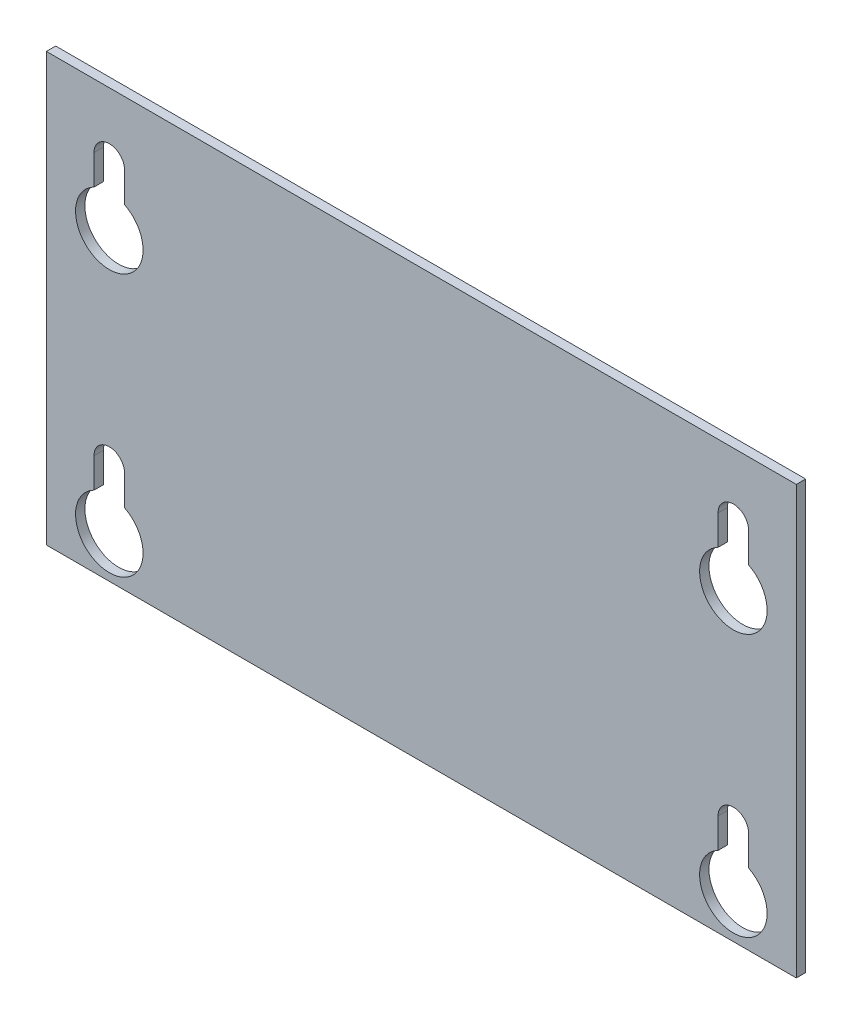
ISO-10303-21;
HEADER;
FILE_DESCRIPTION(('STEP AP214'),'2;1');
FILE_NAME('part.step','',(''),(''),'','','');
FILE_SCHEMA(('AUTOMOTIVE_DESIGN { 1 0 10303 214 1 1 1 1 }'));
ENDSEC;
DATA;
#1=APPLICATION_CONTEXT('core data for automotive mechanical design processes');
#2=APPLICATION_PROTOCOL_DEFINITION('international standard','automotive_design',2000,#1);
#3=PRODUCT_CONTEXT('',#1,'mechanical');
#4=PRODUCT('Part','Part','',(#3));
#5=PRODUCT_RELATED_PRODUCT_CATEGORY('part','',(#4));
#6=PRODUCT_DEFINITION_FORMATION('','',#4);
#7=PRODUCT_DEFINITION_CONTEXT('part definition',#1,'design');
#8=PRODUCT_DEFINITION('design','',#6,#7);
#9=PRODUCT_DEFINITION_SHAPE('','',#8);
#10=(LENGTH_UNIT() NAMED_UNIT(*) SI_UNIT(.MILLI.,.METRE.));
#11=(NAMED_UNIT(*) PLANE_ANGLE_UNIT() SI_UNIT($,.RADIAN.));
#12=(NAMED_UNIT(*) SI_UNIT($,.STERADIAN.) SOLID_ANGLE_UNIT());
#13=UNCERTAINTY_MEASURE_WITH_UNIT(LENGTH_MEASURE(1.E-05),#10,'distance_accuracy_value','');
#14=(GEOMETRIC_REPRESENTATION_CONTEXT(3) GLOBAL_UNCERTAINTY_ASSIGNED_CONTEXT((#13)) GLOBAL_UNIT_ASSIGNED_CONTEXT((#10,
#11,#12)) REPRESENTATION_CONTEXT('',''));
#15=CARTESIAN_POINT('',(0.,0.,0.));
#16=DIRECTION('',(0.,0.,1.));
#17=DIRECTION('',(1.,0.,0.));
#18=AXIS2_PLACEMENT_3D('',#15,#16,#17);
#19=CARTESIAN_POINT('',(50.,31.,-1.245));
#20=DIRECTION('',(1.,0.,0.));
#21=DIRECTION('',(0.,1.,0.));
#22=AXIS2_PLACEMENT_3D('',#19,#20,#21);
#23=PLANE('',#22);
#24=DIRECTION('',(0.,1.,0.));
#25=VECTOR('',#24,1.);
#26=CARTESIAN_POINT('',(50.,31.,0.));
#27=LINE('',#26,#25);
#28=CARTESIAN_POINT('',(50.,-31.,0.));
#29=VERTEX_POINT('',#28);
#30=CARTESIAN_POINT('',(50.,26.,0.));
#31=VERTEX_POINT('',#30);
#32=EDGE_CURVE('E218',#29,#31,#27,.T.);
#33=ORIENTED_EDGE('',*,*,#32,.F.);
#34=DIRECTION('',(0.,0.,1.));
#35=VECTOR('',#34,1.);
#36=CARTESIAN_POINT('',(50.,-31.,-1.245));
#37=LINE('',#36,#35);
#38=CARTESIAN_POINT('',(50.,-31.,-1.245));
#39=VERTEX_POINT('',#38);
#40=EDGE_CURVE('E12',#39,#29,#37,.T.);
#41=ORIENTED_EDGE('',*,*,#40,.F.);
#42=DIRECTION('',(0.,1.,0.));
#43=VECTOR('',#42,1.);
#44=CARTESIAN_POINT('',(50.,31.,-1.245));
#45=LINE('',#44,#43);
#46=CARTESIAN_POINT('',(50.,26.,-1.245));
#47=VERTEX_POINT('',#46);
#48=EDGE_CURVE('E219',#39,#47,#45,.T.);
#49=ORIENTED_EDGE('',*,*,#48,.T.);
#50=DIRECTION('',(0.,0.,1.));
#51=VECTOR('',#50,1.);
#52=CARTESIAN_POINT('',(50.,26.,-1.245));
#53=LINE('',#52,#51);
#54=EDGE_CURVE('E41',#47,#31,#53,.T.);
#55=ORIENTED_EDGE('',*,*,#54,.T.);
#56=EDGE_LOOP('',(#33,#41,#49,#55));
#57=FACE_BOUND('',#56,.T.);
#58=ADVANCED_FACE('F37',(#57),#23,.T.);
#59=CARTESIAN_POINT('',(-50.,-31.,-1.245));
#60=DIRECTION('',(0.,-1.,0.));
#61=DIRECTION('',(0.,0.,-1.));
#62=AXIS2_PLACEMENT_3D('',#59,#60,#61);
#63=PLANE('',#62);
#64=DIRECTION('',(1.,0.,0.));
#65=VECTOR('',#64,1.);
#66=CARTESIAN_POINT('',(-50.,-31.,0.));
#67=LINE('',#66,#65);
#68=CARTESIAN_POINT('',(-50.,-31.,0.));
#69=VERTEX_POINT('',#68);
#70=EDGE_CURVE('E223',#69,#29,#67,.T.);
#71=ORIENTED_EDGE('',*,*,#70,.F.);
#72=DIRECTION('',(0.,0.,1.));
#73=VECTOR('',#72,1.);
#74=CARTESIAN_POINT('',(-50.,-31.,-1.245));
#75=LINE('',#74,#73);
#76=CARTESIAN_POINT('',(-50.,-31.,-1.245));
#77=VERTEX_POINT('',#76);
#78=EDGE_CURVE('E47',#77,#69,#75,.T.);
#79=ORIENTED_EDGE('',*,*,#78,.F.);
#80=DIRECTION('',(1.,0.,0.));
#81=VECTOR('',#80,1.);
#82=CARTESIAN_POINT('',(-50.,-31.,-1.245));
#83=LINE('',#82,#81);
#84=EDGE_CURVE('E227',#77,#39,#83,.T.);
#85=ORIENTED_EDGE('',*,*,#84,.T.);
#86=ORIENTED_EDGE('',*,*,#40,.T.);
#87=EDGE_LOOP('',(#71,#79,#85,#86));
#88=FACE_BOUND('',#87,.T.);
#89=ADVANCED_FACE('F378',(#88),#63,.T.);
#90=CARTESIAN_POINT('',(-50.,31.,-1.245));
#91=DIRECTION('',(-1.,0.,0.));
#92=DIRECTION('',(0.,-1.,0.));
#93=AXIS2_PLACEMENT_3D('',#90,#91,#92);
#94=PLANE('',#93);
#95=DIRECTION('',(0.,-1.,0.));
#96=VECTOR('',#95,1.);
#97=CARTESIAN_POINT('',(-50.,31.,0.));
#98=LINE('',#97,#96);
#99=CARTESIAN_POINT('',(-50.,26.,0.));
#100=VERTEX_POINT('',#99);
#101=EDGE_CURVE('E232',#100,#69,#98,.T.);
#102=ORIENTED_EDGE('',*,*,#101,.F.);
#103=DIRECTION('',(0.,0.,1.));
#104=VECTOR('',#103,1.);
#105=CARTESIAN_POINT('',(-50.,26.,-1.245));
#106=LINE('',#105,#104);
#107=CARTESIAN_POINT('',(-50.,26.,-1.245));
#108=VERTEX_POINT('',#107);
#109=EDGE_CURVE('E238',#108,#100,#106,.T.);
#110=ORIENTED_EDGE('',*,*,#109,.F.);
#111=DIRECTION('',(0.,-1.,0.));
#112=VECTOR('',#111,1.);
#113=CARTESIAN_POINT('',(-50.,31.,-1.245));
#114=LINE('',#113,#112);
#115=EDGE_CURVE('E224',#108,#77,#114,.T.);
#116=ORIENTED_EDGE('',*,*,#115,.T.);
#117=ORIENTED_EDGE('',*,*,#78,.T.);
#118=EDGE_LOOP('',(#102,#110,#116,#117));
#119=FACE_BOUND('',#118,.T.);
#120=ADVANCED_FACE('F382',(#119),#94,.T.);
#121=CARTESIAN_POINT('',(-50.,26.,-1.245));
#122=DIRECTION('',(0.,1.,0.));
#123=DIRECTION('',(0.,0.,1.));
#124=AXIS2_PLACEMENT_3D('',#121,#122,#123);
#125=PLANE('',#124);
#126=DIRECTION('',(-1.,0.,0.));
#127=VECTOR('',#126,1.);
#128=CARTESIAN_POINT('',(0.,26.,0.));
#129=LINE('',#128,#127);
#130=EDGE_CURVE('E231',#31,#100,#129,.T.);
#131=ORIENTED_EDGE('',*,*,#130,.F.);
#132=ORIENTED_EDGE('',*,*,#54,.F.);
#133=DIRECTION('',(-1.,0.,0.));
#134=VECTOR('',#133,1.);
#135=CARTESIAN_POINT('',(0.,26.,-1.245));
#136=LINE('',#135,#134);
#137=EDGE_CURVE('E222',#47,#108,#136,.T.);
#138=ORIENTED_EDGE('',*,*,#137,.T.);
#139=ORIENTED_EDGE('',*,*,#109,.T.);
#140=EDGE_LOOP('',(#131,#132,#138,#139));
#141=FACE_BOUND('',#140,.T.);
#142=ADVANCED_FACE('F39',(#141),#125,.T.);
#143=CARTESIAN_POINT('',(0.,0.,-1.245));
#144=DIRECTION('',(0.,0.,1.));
#145=DIRECTION('',(1.,0.,0.));
#146=AXIS2_PLACEMENT_3D('',#143,#144,#145);
#147=PLANE('',#146);
#148=DIRECTION('',(0.,1.,0.));
#149=VECTOR('',#148,1.);
#150=CARTESIAN_POINT('',(43.6450000000001,-1.51842900438098E-13,-1.245));
#151=LINE('',#150,#149);
#152=CARTESIAN_POINT('',(43.645,-21.488965220794,-1.245));
#153=VERTEX_POINT('',#152);
#154=CARTESIAN_POINT('',(43.645,-17.5,-1.245));
#155=VERTEX_POINT('',#154);
#156=EDGE_CURVE('E342',#153,#155,#151,.T.);
#157=ORIENTED_EDGE('',*,*,#156,.T.);
#158=CARTESIAN_POINT('',(41.605,-17.5,-1.245));
#159=DIRECTION('',(0.,0.,1.));
#160=DIRECTION('',(1.,0.,0.));
#161=AXIS2_PLACEMENT_3D('',#158,#159,#160);
#162=CIRCLE('',#161,2.04000000000001);
#163=CARTESIAN_POINT('',(39.565,-17.5,-1.245));
#164=VERTEX_POINT('',#163);
#165=EDGE_CURVE('E345',#155,#164,#162,.T.);
#166=ORIENTED_EDGE('',*,*,#165,.T.);
#167=DIRECTION('',(0.,-1.,0.));
#168=VECTOR('',#167,1.);
#169=CARTESIAN_POINT('',(39.5650000000001,-1.37648398575629E-13,-1.245));
#170=LINE('',#169,#168);
#171=CARTESIAN_POINT('',(39.565,-21.488965220794,-1.245));
#172=VERTEX_POINT('',#171);
#173=EDGE_CURVE('E337',#164,#172,#170,.T.);
#174=ORIENTED_EDGE('',*,*,#173,.T.);
#175=CARTESIAN_POINT('',(41.605,-25.5,-1.245));
#176=DIRECTION('',(0.,0.,1.));
#177=DIRECTION('',(1.,0.,0.));
#178=AXIS2_PLACEMENT_3D('',#175,#176,#177);
#179=CIRCLE('',#178,4.5);
#180=EDGE_CURVE('E313',#172,#153,#179,.T.);
#181=ORIENTED_EDGE('',*,*,#180,.T.);
#182=EDGE_LOOP('',(#157,#166,#174,#181));
#183=FACE_BOUND('',#182,.T.);
#184=DIRECTION('',(0.,1.,0.));
#185=VECTOR('',#184,1.);
#186=CARTESIAN_POINT('',(-39.565,0.,-1.245));
#187=LINE('',#186,#185);
#188=CARTESIAN_POINT('',(-39.565,-21.488965220794,-1.245));
#189=VERTEX_POINT('',#188);
#190=CARTESIAN_POINT('',(-39.565,-17.5,-1.245));
#191=VERTEX_POINT('',#190);
#192=EDGE_CURVE('E133',#189,#191,#187,.T.);
#193=ORIENTED_EDGE('',*,*,#192,.T.);
#194=CARTESIAN_POINT('',(-41.605,-17.5,-1.245));
#195=DIRECTION('',(0.,0.,1.));
#196=DIRECTION('',(1.,0.,0.));
#197=AXIS2_PLACEMENT_3D('',#194,#195,#196);
#198=CIRCLE('',#197,2.04);
#199=CARTESIAN_POINT('',(-43.645,-17.5,-1.245));
#200=VERTEX_POINT('',#199);
#201=EDGE_CURVE('E139',#191,#200,#198,.T.);
#202=ORIENTED_EDGE('',*,*,#201,.T.);
#203=DIRECTION('',(0.,-1.,0.));
#204=VECTOR('',#203,1.);
#205=CARTESIAN_POINT('',(-43.6449999999999,1.51842900438098E-13,-1.245));
#206=LINE('',#205,#204);
#207=CARTESIAN_POINT('',(-43.645,-21.488965220794,-1.245));
#208=VERTEX_POINT('',#207);
#209=EDGE_CURVE('E114',#200,#208,#206,.T.);
#210=ORIENTED_EDGE('',*,*,#209,.T.);
#211=CARTESIAN_POINT('',(-41.605,-25.5,-1.245));
#212=DIRECTION('',(0.,0.,1.));
#213=DIRECTION('',(1.,0.,0.));
#214=AXIS2_PLACEMENT_3D('',#211,#212,#213);
#215=CIRCLE('',#214,4.5);
#216=EDGE_CURVE('E127',#208,#189,#215,.T.);
#217=ORIENTED_EDGE('',*,*,#216,.T.);
#218=EDGE_LOOP('',(#193,#202,#210,#217));
#219=FACE_BOUND('',#218,.T.);
#220=DIRECTION('',(0.,1.,0.));
#221=VECTOR('',#220,1.);
#222=CARTESIAN_POINT('',(43.645,0.,-1.245));
#223=LINE('',#222,#221);
#224=CARTESIAN_POINT('',(43.645,13.511034779206,-1.245));
#225=VERTEX_POINT('',#224);
#226=CARTESIAN_POINT('',(43.645,17.5,-1.245));
#227=VERTEX_POINT('',#226);
#228=EDGE_CURVE('E177',#225,#227,#223,.T.);
#229=ORIENTED_EDGE('',*,*,#228,.T.);
#230=CARTESIAN_POINT('',(41.605,17.5,-1.245));
#231=DIRECTION('',(0.,0.,1.));
#232=DIRECTION('',(1.,0.,0.));
#233=AXIS2_PLACEMENT_3D('',#230,#231,#232);
#234=CIRCLE('',#233,2.04000000000001);
#235=CARTESIAN_POINT('',(39.565,17.5,-1.245));
#236=VERTEX_POINT('',#235);
#237=EDGE_CURVE('E180',#227,#236,#234,.T.);
#238=ORIENTED_EDGE('',*,*,#237,.T.);
#239=DIRECTION('',(0.,-1.,0.));
#240=VECTOR('',#239,1.);
#241=CARTESIAN_POINT('',(39.565,0.,-1.245));
#242=LINE('',#241,#240);
#243=CARTESIAN_POINT('',(39.565,13.511034779206,-1.245));
#244=VERTEX_POINT('',#243);
#245=EDGE_CURVE('E163',#236,#244,#242,.T.);
#246=ORIENTED_EDGE('',*,*,#245,.T.);
#247=CARTESIAN_POINT('',(41.605,9.5,-1.245));
#248=DIRECTION('',(0.,0.,1.));
#249=DIRECTION('',(1.,0.,0.));
#250=AXIS2_PLACEMENT_3D('',#247,#248,#249);
#251=CIRCLE('',#250,4.5);
#252=EDGE_CURVE('E174',#244,#225,#251,.T.);
#253=ORIENTED_EDGE('',*,*,#252,.T.);
#254=EDGE_LOOP('',(#229,#238,#246,#253));
#255=FACE_BOUND('',#254,.T.);
#256=DIRECTION('',(0.,1.,0.));
#257=VECTOR('',#256,1.);
#258=CARTESIAN_POINT('',(-39.565,0.,-1.245));
#259=LINE('',#258,#257);
#260=CARTESIAN_POINT('',(-39.565,13.511034779206,-1.245));
#261=VERTEX_POINT('',#260);
#262=CARTESIAN_POINT('',(-39.565,17.5,-1.245));
#263=VERTEX_POINT('',#262);
#264=EDGE_CURVE('E212',#261,#263,#259,.T.);
#265=ORIENTED_EDGE('',*,*,#264,.T.);
#266=CARTESIAN_POINT('',(-41.605,17.5,-1.245));
#267=DIRECTION('',(0.,0.,1.));
#268=DIRECTION('',(1.,0.,0.));
#269=AXIS2_PLACEMENT_3D('',#266,#267,#268);
#270=CIRCLE('',#269,2.04000000000001);
#271=CARTESIAN_POINT('',(-43.645,17.5,-1.245));
#272=VERTEX_POINT('',#271);
#273=EDGE_CURVE('E215',#263,#272,#270,.T.);
#274=ORIENTED_EDGE('',*,*,#273,.T.);
#275=DIRECTION('',(0.,-1.,0.));
#276=VECTOR('',#275,1.);
#277=CARTESIAN_POINT('',(-43.645,0.,-1.245));
#278=LINE('',#277,#276);
#279=CARTESIAN_POINT('',(-43.645,13.511034779206,-1.245));
#280=VERTEX_POINT('',#279);
#281=EDGE_CURVE('E198',#272,#280,#278,.T.);
#282=ORIENTED_EDGE('',*,*,#281,.T.);
#283=CARTESIAN_POINT('',(-41.605,9.5,-1.245));
#284=DIRECTION('',(0.,0.,1.));
#285=DIRECTION('',(1.,0.,0.));
#286=AXIS2_PLACEMENT_3D('',#283,#284,#285);
#287=CIRCLE('',#286,4.5);
#288=EDGE_CURVE('E209',#280,#261,#287,.T.);
#289=ORIENTED_EDGE('',*,*,#288,.T.);
#290=EDGE_LOOP('',(#265,#274,#282,#289));
#291=FACE_BOUND('',#290,.T.);
#292=ORIENTED_EDGE('',*,*,#48,.F.);
#293=ORIENTED_EDGE('',*,*,#84,.F.);
#294=ORIENTED_EDGE('',*,*,#115,.F.);
#295=ORIENTED_EDGE('',*,*,#137,.F.);
#296=EDGE_LOOP('',(#292,#293,#294,#295));
#297=FACE_BOUND('',#296,.T.);
#298=ADVANCED_FACE('F136',(#183,#219,#255,#291,#297),#147,.F.);
#299=CARTESIAN_POINT('',(0.,0.,0.));
#300=DIRECTION('',(0.,0.,1.));
#301=DIRECTION('',(1.,0.,0.));
#302=AXIS2_PLACEMENT_3D('',#299,#300,#301);
#303=PLANE('',#302);
#304=CARTESIAN_POINT('',(41.605,-17.5,0.));
#305=DIRECTION('',(0.,0.,1.));
#306=DIRECTION('',(1.,0.,0.));
#307=AXIS2_PLACEMENT_3D('',#304,#305,#306);
#308=CIRCLE('',#307,2.04000000000001);
#309=CARTESIAN_POINT('',(43.645,-17.5,0.));
#310=VERTEX_POINT('',#309);
#311=CARTESIAN_POINT('',(39.565,-17.5,0.));
#312=VERTEX_POINT('',#311);
#313=EDGE_CURVE('E325',#310,#312,#308,.T.);
#314=ORIENTED_EDGE('',*,*,#313,.F.);
#315=DIRECTION('',(0.,1.,0.));
#316=VECTOR('',#315,1.);
#317=CARTESIAN_POINT('',(43.645,-17.5,0.));
#318=LINE('',#317,#316);
#319=CARTESIAN_POINT('',(43.645,-21.488965220794,0.));
#320=VERTEX_POINT('',#319);
#321=EDGE_CURVE('E330',#320,#310,#318,.T.);
#322=ORIENTED_EDGE('',*,*,#321,.F.);
#323=CARTESIAN_POINT('',(41.605,-25.5,0.));
#324=DIRECTION('',(0.,0.,1.));
#325=DIRECTION('',(1.,0.,0.));
#326=AXIS2_PLACEMENT_3D('',#323,#324,#325);
#327=CIRCLE('',#326,4.5);
#328=CARTESIAN_POINT('',(39.565,-21.488965220794,0.));
#329=VERTEX_POINT('',#328);
#330=EDGE_CURVE('E310',#329,#320,#327,.T.);
#331=ORIENTED_EDGE('',*,*,#330,.F.);
#332=DIRECTION('',(0.,-1.,0.));
#333=VECTOR('',#332,1.);
#334=CARTESIAN_POINT('',(39.565,-17.5,0.));
#335=LINE('',#334,#333);
#336=EDGE_CURVE('E320',#312,#329,#335,.T.);
#337=ORIENTED_EDGE('',*,*,#336,.F.);
#338=EDGE_LOOP('',(#314,#322,#331,#337));
#339=FACE_BOUND('',#338,.T.);
#340=CARTESIAN_POINT('',(-41.605,-17.5,0.));
#341=DIRECTION('',(0.,0.,1.));
#342=DIRECTION('',(1.,0.,0.));
#343=AXIS2_PLACEMENT_3D('',#340,#341,#342);
#344=CIRCLE('',#343,2.04);
#345=CARTESIAN_POINT('',(-39.565,-17.5,0.));
#346=VERTEX_POINT('',#345);
#347=CARTESIAN_POINT('',(-43.645,-17.5,0.));
#348=VERTEX_POINT('',#347);
#349=EDGE_CURVE('E348',#346,#348,#344,.T.);
#350=ORIENTED_EDGE('',*,*,#349,.F.);
#351=DIRECTION('',(0.,1.,0.));
#352=VECTOR('',#351,1.);
#353=CARTESIAN_POINT('',(-39.565,-17.5,0.));
#354=LINE('',#353,#352);
#355=CARTESIAN_POINT('',(-39.565,-21.488965220794,0.));
#356=VERTEX_POINT('',#355);
#357=EDGE_CURVE('E353',#356,#346,#354,.T.);
#358=ORIENTED_EDGE('',*,*,#357,.F.);
#359=CARTESIAN_POINT('',(-41.605,-25.5,0.));
#360=DIRECTION('',(0.,0.,1.));
#361=DIRECTION('',(1.,0.,0.));
#362=AXIS2_PLACEMENT_3D('',#359,#360,#361);
#363=CIRCLE('',#362,4.5);
#364=CARTESIAN_POINT('',(-43.645,-21.488965220794,0.));
#365=VERTEX_POINT('',#364);
#366=EDGE_CURVE('E351',#365,#356,#363,.T.);
#367=ORIENTED_EDGE('',*,*,#366,.F.);
#368=DIRECTION('',(0.,-1.,0.));
#369=VECTOR('',#368,1.);
#370=CARTESIAN_POINT('',(-43.645,-17.5,0.));
#371=LINE('',#370,#369);
#372=EDGE_CURVE('E118',#348,#365,#371,.T.);
#373=ORIENTED_EDGE('',*,*,#372,.F.);
#374=EDGE_LOOP('',(#350,#358,#367,#373));
#375=FACE_BOUND('',#374,.T.);
#376=CARTESIAN_POINT('',(41.605,17.5,0.));
#377=DIRECTION('',(0.,0.,1.));
#378=DIRECTION('',(1.,0.,0.));
#379=AXIS2_PLACEMENT_3D('',#376,#377,#378);
#380=CIRCLE('',#379,2.04000000000001);
#381=CARTESIAN_POINT('',(43.645,17.5,0.));
#382=VERTEX_POINT('',#381);
#383=CARTESIAN_POINT('',(39.565,17.5,0.));
#384=VERTEX_POINT('',#383);
#385=EDGE_CURVE('E148',#382,#384,#380,.T.);
#386=ORIENTED_EDGE('',*,*,#385,.F.);
#387=DIRECTION('',(0.,1.,0.));
#388=VECTOR('',#387,1.);
#389=CARTESIAN_POINT('',(43.645,17.5,0.));
#390=LINE('',#389,#388);
#391=CARTESIAN_POINT('',(43.645,13.511034779206,0.));
#392=VERTEX_POINT('',#391);
#393=EDGE_CURVE('E156',#392,#382,#390,.T.);
#394=ORIENTED_EDGE('',*,*,#393,.F.);
#395=CARTESIAN_POINT('',(41.605,9.5,0.));
#396=DIRECTION('',(0.,0.,1.));
#397=DIRECTION('',(1.,0.,0.));
#398=AXIS2_PLACEMENT_3D('',#395,#396,#397);
#399=CIRCLE('',#398,4.5);
#400=CARTESIAN_POINT('',(39.565,13.511034779206,0.));
#401=VERTEX_POINT('',#400);
#402=EDGE_CURVE('E153',#401,#392,#399,.T.);
#403=ORIENTED_EDGE('',*,*,#402,.F.);
#404=DIRECTION('',(0.,-1.,0.));
#405=VECTOR('',#404,1.);
#406=CARTESIAN_POINT('',(39.565,17.5,0.));
#407=LINE('',#406,#405);
#408=EDGE_CURVE('E150',#384,#401,#407,.T.);
#409=ORIENTED_EDGE('',*,*,#408,.F.);
#410=EDGE_LOOP('',(#386,#394,#403,#409));
#411=FACE_BOUND('',#410,.T.);
#412=CARTESIAN_POINT('',(-41.605,17.5,0.));
#413=DIRECTION('',(0.,0.,1.));
#414=DIRECTION('',(1.,0.,0.));
#415=AXIS2_PLACEMENT_3D('',#412,#413,#414);
#416=CIRCLE('',#415,2.04000000000001);
#417=CARTESIAN_POINT('',(-39.565,17.5,0.));
#418=VERTEX_POINT('',#417);
#419=CARTESIAN_POINT('',(-43.645,17.5,0.));
#420=VERTEX_POINT('',#419);
#421=EDGE_CURVE('E183',#418,#420,#416,.T.);
#422=ORIENTED_EDGE('',*,*,#421,.F.);
#423=DIRECTION('',(0.,1.,0.));
#424=VECTOR('',#423,1.);
#425=CARTESIAN_POINT('',(-39.565,17.5,0.));
#426=LINE('',#425,#424);
#427=CARTESIAN_POINT('',(-39.565,13.511034779206,0.));
#428=VERTEX_POINT('',#427);
#429=EDGE_CURVE('E191',#428,#418,#426,.T.);
#430=ORIENTED_EDGE('',*,*,#429,.F.);
#431=CARTESIAN_POINT('',(-41.605,9.5,0.));
#432=DIRECTION('',(0.,0.,1.));
#433=DIRECTION('',(1.,0.,0.));
#434=AXIS2_PLACEMENT_3D('',#431,#432,#433);
#435=CIRCLE('',#434,4.5);
#436=CARTESIAN_POINT('',(-43.645,13.511034779206,0.));
#437=VERTEX_POINT('',#436);
#438=EDGE_CURVE('E188',#437,#428,#435,.T.);
#439=ORIENTED_EDGE('',*,*,#438,.F.);
#440=DIRECTION('',(0.,-1.,0.));
#441=VECTOR('',#440,1.);
#442=CARTESIAN_POINT('',(-43.645,17.5,0.));
#443=LINE('',#442,#441);
#444=EDGE_CURVE('E185',#420,#437,#443,.T.);
#445=ORIENTED_EDGE('',*,*,#444,.F.);
#446=EDGE_LOOP('',(#422,#430,#439,#445));
#447=FACE_BOUND('',#446,.T.);
#448=ORIENTED_EDGE('',*,*,#32,.T.);
#449=ORIENTED_EDGE('',*,*,#130,.T.);
#450=ORIENTED_EDGE('',*,*,#101,.T.);
#451=ORIENTED_EDGE('',*,*,#70,.T.);
#452=EDGE_LOOP('',(#448,#449,#450,#451));
#453=FACE_BOUND('',#452,.T.);
#454=ADVANCED_FACE('F327',(#339,#375,#411,#447,#453),#303,.T.);
#455=CARTESIAN_POINT('',(-41.605,17.5,-10.));
#456=DIRECTION('',(0.,0.,1.));
#457=DIRECTION('',(1.,0.,0.));
#458=AXIS2_PLACEMENT_3D('',#455,#456,#457);
#459=CYLINDRICAL_SURFACE('',#458,2.04000000000001);
#460=DIRECTION('',(0.,0.,1.));
#461=VECTOR('',#460,1.);
#462=CARTESIAN_POINT('',(-39.565,17.5,-10.));
#463=LINE('',#462,#461);
#464=EDGE_CURVE('E195',#263,#418,#463,.T.);
#465=ORIENTED_EDGE('',*,*,#464,.T.);
#466=ORIENTED_EDGE('',*,*,#421,.T.);
#467=DIRECTION('',(0.,0.,1.));
#468=VECTOR('',#467,1.);
#469=CARTESIAN_POINT('',(-43.645,17.5,-10.));
#470=LINE('',#469,#468);
#471=EDGE_CURVE('E194',#272,#420,#470,.T.);
#472=ORIENTED_EDGE('',*,*,#471,.F.);
#473=ORIENTED_EDGE('',*,*,#273,.F.);
#474=EDGE_LOOP('',(#465,#466,#472,#473));
#475=FACE_BOUND('',#474,.T.);
#476=ADVANCED_FACE('F390',(#475),#459,.F.);
#477=CARTESIAN_POINT('',(-39.565,17.5,-10.));
#478=DIRECTION('',(1.,0.,0.));
#479=DIRECTION('',(0.,0.,-1.));
#480=AXIS2_PLACEMENT_3D('',#477,#478,#479);
#481=PLANE('',#480);
#482=DIRECTION('',(0.,0.,1.));
#483=VECTOR('',#482,1.);
#484=CARTESIAN_POINT('',(-39.565,13.511034779206,-10.));
#485=LINE('',#484,#483);
#486=EDGE_CURVE('E199',#261,#428,#485,.T.);
#487=ORIENTED_EDGE('',*,*,#486,.T.);
#488=ORIENTED_EDGE('',*,*,#429,.T.);
#489=ORIENTED_EDGE('',*,*,#464,.F.);
#490=ORIENTED_EDGE('',*,*,#264,.F.);
#491=EDGE_LOOP('',(#487,#488,#489,#490));
#492=FACE_BOUND('',#491,.T.);
#493=ADVANCED_FACE('F396',(#492),#481,.F.);
#494=CARTESIAN_POINT('',(-41.605,9.5,-10.));
#495=DIRECTION('',(0.,0.,1.));
#496=DIRECTION('',(1.,0.,0.));
#497=AXIS2_PLACEMENT_3D('',#494,#495,#496);
#498=CYLINDRICAL_SURFACE('',#497,4.5);
#499=DIRECTION('',(0.,0.,1.));
#500=VECTOR('',#499,1.);
#501=CARTESIAN_POINT('',(-43.645,13.511034779206,-10.));
#502=LINE('',#501,#500);
#503=EDGE_CURVE('E202',#280,#437,#502,.T.);
#504=ORIENTED_EDGE('',*,*,#503,.T.);
#505=ORIENTED_EDGE('',*,*,#438,.T.);
#506=ORIENTED_EDGE('',*,*,#486,.F.);
#507=ORIENTED_EDGE('',*,*,#288,.F.);
#508=EDGE_LOOP('',(#504,#505,#506,#507));
#509=FACE_BOUND('',#508,.T.);
#510=ADVANCED_FACE('F402',(#509),#498,.F.);
#511=CARTESIAN_POINT('',(-43.645,17.5,-10.));
#512=DIRECTION('',(-1.,0.,0.));
#513=DIRECTION('',(0.,0.,1.));
#514=AXIS2_PLACEMENT_3D('',#511,#512,#513);
#515=PLANE('',#514);
#516=ORIENTED_EDGE('',*,*,#471,.T.);
#517=ORIENTED_EDGE('',*,*,#444,.T.);
#518=ORIENTED_EDGE('',*,*,#503,.F.);
#519=ORIENTED_EDGE('',*,*,#281,.F.);
#520=EDGE_LOOP('',(#516,#517,#518,#519));
#521=FACE_BOUND('',#520,.T.);
#522=ADVANCED_FACE('F398',(#521),#515,.F.);
#523=CARTESIAN_POINT('',(41.605,17.5,-10.));
#524=DIRECTION('',(0.,0.,1.));
#525=DIRECTION('',(1.,0.,0.));
#526=AXIS2_PLACEMENT_3D('',#523,#524,#525);
#527=CYLINDRICAL_SURFACE('',#526,2.04000000000001);
#528=DIRECTION('',(0.,0.,1.));
#529=VECTOR('',#528,1.);
#530=CARTESIAN_POINT('',(43.645,17.5,-10.));
#531=LINE('',#530,#529);
#532=EDGE_CURVE('E160',#227,#382,#531,.T.);
#533=ORIENTED_EDGE('',*,*,#532,.T.);
#534=ORIENTED_EDGE('',*,*,#385,.T.);
#535=DIRECTION('',(0.,0.,1.));
#536=VECTOR('',#535,1.);
#537=CARTESIAN_POINT('',(39.565,17.5,-10.));
#538=LINE('',#537,#536);
#539=EDGE_CURVE('E159',#236,#384,#538,.T.);
#540=ORIENTED_EDGE('',*,*,#539,.F.);
#541=ORIENTED_EDGE('',*,*,#237,.F.);
#542=EDGE_LOOP('',(#533,#534,#540,#541));
#543=FACE_BOUND('',#542,.T.);
#544=ADVANCED_FACE('F401',(#543),#527,.F.);
#545=CARTESIAN_POINT('',(43.645,17.5,-10.));
#546=DIRECTION('',(1.,0.,0.));
#547=DIRECTION('',(0.,0.,-1.));
#548=AXIS2_PLACEMENT_3D('',#545,#546,#547);
#549=PLANE('',#548);
#550=DIRECTION('',(0.,0.,1.));
#551=VECTOR('',#550,1.);
#552=CARTESIAN_POINT('',(43.645,13.511034779206,-10.));
#553=LINE('',#552,#551);
#554=EDGE_CURVE('E164',#225,#392,#553,.T.);
#555=ORIENTED_EDGE('',*,*,#554,.T.);
#556=ORIENTED_EDGE('',*,*,#393,.T.);
#557=ORIENTED_EDGE('',*,*,#532,.F.);
#558=ORIENTED_EDGE('',*,*,#228,.F.);
#559=EDGE_LOOP('',(#555,#556,#557,#558));
#560=FACE_BOUND('',#559,.T.);
#561=ADVANCED_FACE('F411',(#560),#549,.F.);
#562=CARTESIAN_POINT('',(41.605,9.5,-10.));
#563=DIRECTION('',(0.,0.,1.));
#564=DIRECTION('',(1.,0.,0.));
#565=AXIS2_PLACEMENT_3D('',#562,#563,#564);
#566=CYLINDRICAL_SURFACE('',#565,4.5);
#567=DIRECTION('',(0.,0.,1.));
#568=VECTOR('',#567,1.);
#569=CARTESIAN_POINT('',(39.565,13.511034779206,-10.));
#570=LINE('',#569,#568);
#571=EDGE_CURVE('E167',#244,#401,#570,.T.);
#572=ORIENTED_EDGE('',*,*,#571,.T.);
#573=ORIENTED_EDGE('',*,*,#402,.T.);
#574=ORIENTED_EDGE('',*,*,#554,.F.);
#575=ORIENTED_EDGE('',*,*,#252,.F.);
#576=EDGE_LOOP('',(#572,#573,#574,#575));
#577=FACE_BOUND('',#576,.T.);
#578=ADVANCED_FACE('F372',(#577),#566,.F.);
#579=CARTESIAN_POINT('',(39.565,17.5,-10.));
#580=DIRECTION('',(-1.,0.,0.));
#581=DIRECTION('',(0.,0.,1.));
#582=AXIS2_PLACEMENT_3D('',#579,#580,#581);
#583=PLANE('',#582);
#584=ORIENTED_EDGE('',*,*,#539,.T.);
#585=ORIENTED_EDGE('',*,*,#408,.T.);
#586=ORIENTED_EDGE('',*,*,#571,.F.);
#587=ORIENTED_EDGE('',*,*,#245,.F.);
#588=EDGE_LOOP('',(#584,#585,#586,#587));
#589=FACE_BOUND('',#588,.T.);
#590=ADVANCED_FACE('F365',(#589),#583,.F.);
#591=CARTESIAN_POINT('',(-41.605,-17.5,-10.));
#592=DIRECTION('',(0.,0.,1.));
#593=DIRECTION('',(1.,0.,0.));
#594=AXIS2_PLACEMENT_3D('',#591,#592,#593);
#595=CYLINDRICAL_SURFACE('',#594,2.04);
#596=DIRECTION('',(0.,0.,1.));
#597=VECTOR('',#596,1.);
#598=CARTESIAN_POINT('',(-39.565,-17.5,-10.));
#599=LINE('',#598,#597);
#600=EDGE_CURVE('E140',#191,#346,#599,.T.);
#601=ORIENTED_EDGE('',*,*,#600,.T.);
#602=ORIENTED_EDGE('',*,*,#349,.T.);
#603=DIRECTION('',(0.,0.,1.));
#604=VECTOR('',#603,1.);
#605=CARTESIAN_POINT('',(-43.645,-17.5,-10.));
#606=LINE('',#605,#604);
#607=EDGE_CURVE('E123',#200,#348,#606,.T.);
#608=ORIENTED_EDGE('',*,*,#607,.F.);
#609=ORIENTED_EDGE('',*,*,#201,.F.);
#610=EDGE_LOOP('',(#601,#602,#608,#609));
#611=FACE_BOUND('',#610,.T.);
#612=ADVANCED_FACE('F363',(#611),#595,.F.);
#613=CARTESIAN_POINT('',(-39.565,-17.5,-10.));
#614=DIRECTION('',(1.,0.,0.));
#615=DIRECTION('',(0.,0.,-1.));
#616=AXIS2_PLACEMENT_3D('',#613,#614,#615);
#617=PLANE('',#616);
#618=DIRECTION('',(0.,0.,1.));
#619=VECTOR('',#618,1.);
#620=CARTESIAN_POINT('',(-39.565,-21.488965220794,-10.));
#621=LINE('',#620,#619);
#622=EDGE_CURVE('E122',#189,#356,#621,.T.);
#623=ORIENTED_EDGE('',*,*,#622,.T.);
#624=ORIENTED_EDGE('',*,*,#357,.T.);
#625=ORIENTED_EDGE('',*,*,#600,.F.);
#626=ORIENTED_EDGE('',*,*,#192,.F.);
#627=EDGE_LOOP('',(#623,#624,#625,#626));
#628=FACE_BOUND('',#627,.T.);
#629=ADVANCED_FACE('F357',(#628),#617,.F.);
#630=CARTESIAN_POINT('',(-41.605,-25.5,-10.));
#631=DIRECTION('',(0.,0.,1.));
#632=DIRECTION('',(1.,0.,0.));
#633=AXIS2_PLACEMENT_3D('',#630,#631,#632);
#634=CYLINDRICAL_SURFACE('',#633,4.5);
#635=DIRECTION('',(0.,0.,1.));
#636=VECTOR('',#635,1.);
#637=CARTESIAN_POINT('',(-43.645,-21.488965220794,-10.));
#638=LINE('',#637,#636);
#639=EDGE_CURVE('E108',#208,#365,#638,.T.);
#640=ORIENTED_EDGE('',*,*,#639,.T.);
#641=ORIENTED_EDGE('',*,*,#366,.T.);
#642=ORIENTED_EDGE('',*,*,#622,.F.);
#643=ORIENTED_EDGE('',*,*,#216,.F.);
#644=EDGE_LOOP('',(#640,#641,#642,#643));
#645=FACE_BOUND('',#644,.T.);
#646=ADVANCED_FACE('F128',(#645),#634,.F.);
#647=CARTESIAN_POINT('',(-43.645,-17.5,-10.));
#648=DIRECTION('',(-1.,0.,0.));
#649=DIRECTION('',(0.,-1.,0.));
#650=AXIS2_PLACEMENT_3D('',#647,#648,#649);
#651=PLANE('',#650);
#652=ORIENTED_EDGE('',*,*,#607,.T.);
#653=ORIENTED_EDGE('',*,*,#372,.T.);
#654=ORIENTED_EDGE('',*,*,#639,.F.);
#655=ORIENTED_EDGE('',*,*,#209,.F.);
#656=EDGE_LOOP('',(#652,#653,#654,#655));
#657=FACE_BOUND('',#656,.T.);
#658=ADVANCED_FACE('F111',(#657),#651,.F.);
#659=CARTESIAN_POINT('',(41.605,-17.5,-10.));
#660=DIRECTION('',(0.,0.,1.));
#661=DIRECTION('',(1.,0.,0.));
#662=AXIS2_PLACEMENT_3D('',#659,#660,#661);
#663=CYLINDRICAL_SURFACE('',#662,2.04000000000001);
#664=DIRECTION('',(0.,0.,1.));
#665=VECTOR('',#664,1.);
#666=CARTESIAN_POINT('',(43.645,-17.5,-10.));
#667=LINE('',#666,#665);
#668=EDGE_CURVE('E335',#155,#310,#667,.T.);
#669=ORIENTED_EDGE('',*,*,#668,.T.);
#670=ORIENTED_EDGE('',*,*,#313,.T.);
#671=DIRECTION('',(0.,0.,1.));
#672=VECTOR('',#671,1.);
#673=CARTESIAN_POINT('',(39.565,-17.5,-10.));
#674=LINE('',#673,#672);
#675=EDGE_CURVE('E316',#164,#312,#674,.T.);
#676=ORIENTED_EDGE('',*,*,#675,.F.);
#677=ORIENTED_EDGE('',*,*,#165,.F.);
#678=EDGE_LOOP('',(#669,#670,#676,#677));
#679=FACE_BOUND('',#678,.T.);
#680=ADVANCED_FACE('F480',(#679),#663,.F.);
#681=CARTESIAN_POINT('',(43.645,-17.5,-10.));
#682=DIRECTION('',(1.,0.,0.));
#683=DIRECTION('',(0.,1.,0.));
#684=AXIS2_PLACEMENT_3D('',#681,#682,#683);
#685=PLANE('',#684);
#686=DIRECTION('',(0.,0.,1.));
#687=VECTOR('',#686,1.);
#688=CARTESIAN_POINT('',(43.645,-21.488965220794,-10.));
#689=LINE('',#688,#687);
#690=EDGE_CURVE('E315',#153,#320,#689,.T.);
#691=ORIENTED_EDGE('',*,*,#690,.T.);
#692=ORIENTED_EDGE('',*,*,#321,.T.);
#693=ORIENTED_EDGE('',*,*,#668,.F.);
#694=ORIENTED_EDGE('',*,*,#156,.F.);
#695=EDGE_LOOP('',(#691,#692,#693,#694));
#696=FACE_BOUND('',#695,.T.);
#697=ADVANCED_FACE('F489',(#696),#685,.F.);
#698=CARTESIAN_POINT('',(41.605,-25.5,-10.));
#699=DIRECTION('',(0.,0.,1.));
#700=DIRECTION('',(1.,0.,0.));
#701=AXIS2_PLACEMENT_3D('',#698,#699,#700);
#702=CYLINDRICAL_SURFACE('',#701,4.5);
#703=DIRECTION('',(0.,0.,1.));
#704=VECTOR('',#703,1.);
#705=CARTESIAN_POINT('',(39.565,-21.488965220794,-10.));
#706=LINE('',#705,#704);
#707=EDGE_CURVE('E56',#172,#329,#706,.T.);
#708=ORIENTED_EDGE('',*,*,#707,.T.);
#709=ORIENTED_EDGE('',*,*,#330,.T.);
#710=ORIENTED_EDGE('',*,*,#690,.F.);
#711=ORIENTED_EDGE('',*,*,#180,.F.);
#712=EDGE_LOOP('',(#708,#709,#710,#711));
#713=FACE_BOUND('',#712,.T.);
#714=ADVANCED_FACE('F307',(#713),#702,.F.);
#715=CARTESIAN_POINT('',(39.565,-17.5,-10.));
#716=DIRECTION('',(-1.,0.,0.));
#717=DIRECTION('',(0.,-1.,0.));
#718=AXIS2_PLACEMENT_3D('',#715,#716,#717);
#719=PLANE('',#718);
#720=ORIENTED_EDGE('',*,*,#675,.T.);
#721=ORIENTED_EDGE('',*,*,#336,.T.);
#722=ORIENTED_EDGE('',*,*,#707,.F.);
#723=ORIENTED_EDGE('',*,*,#173,.F.);
#724=EDGE_LOOP('',(#720,#721,#722,#723));
#725=FACE_BOUND('',#724,.T.);
#726=ADVANCED_FACE('F321',(#725),#719,.F.);
#727=CLOSED_SHELL('',(#58,#89,#120,#142,#298,#454,#476,#493,#510,#522,#544,#561,#578,#590,#612,
#629,#646,#658,#680,#697,#714,#726));
#728=MANIFOLD_SOLID_BREP('B2',#727);
#729=ADVANCED_BREP_SHAPE_REPRESENTATION('',(#18,#728),#14);
#730=SHAPE_DEFINITION_REPRESENTATION(#9,#729);
ENDSEC;
END-ISO-10303-21;
